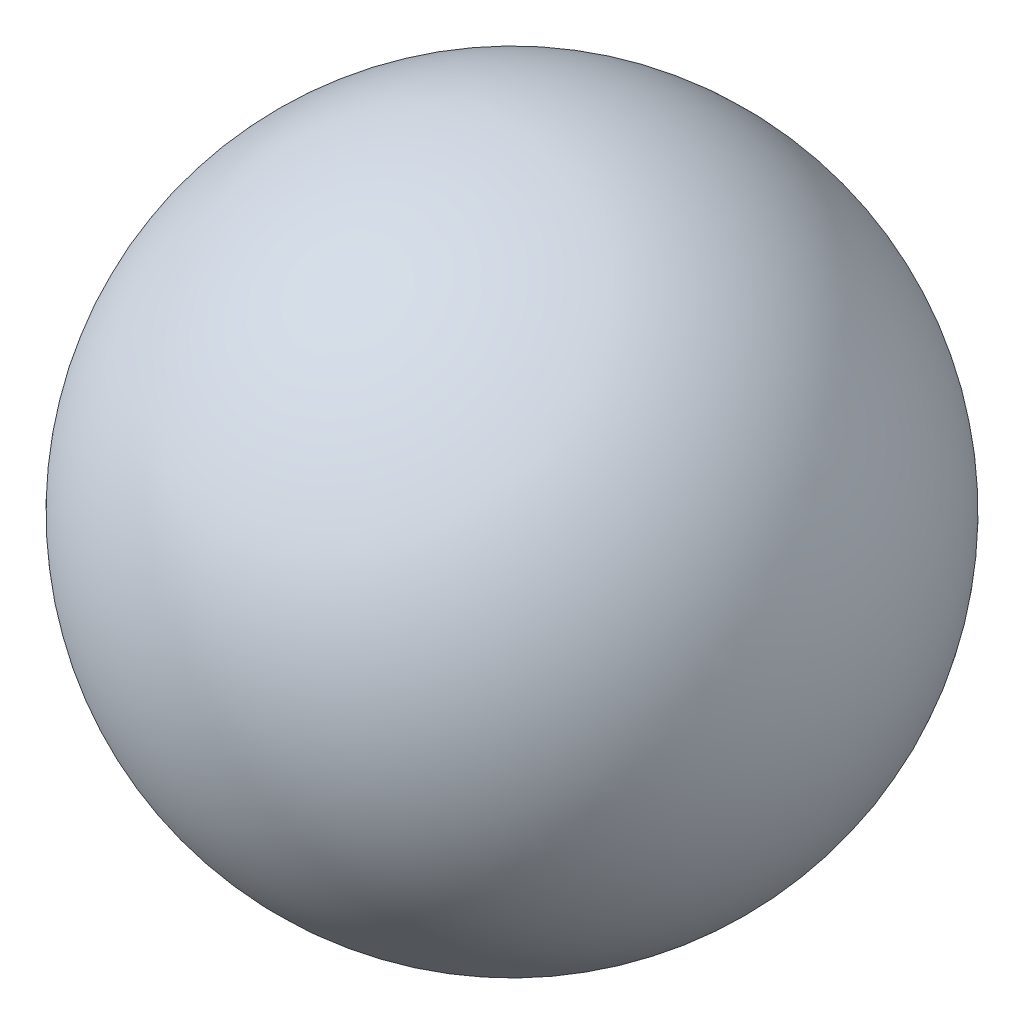
ISO-10303-21;
HEADER;
FILE_DESCRIPTION(('STEP AP214'),'2;1');
FILE_NAME('part.step','',(''),(''),'','','');
FILE_SCHEMA(('AUTOMOTIVE_DESIGN { 1 0 10303 214 1 1 1 1 }'));
ENDSEC;
DATA;
#1=APPLICATION_CONTEXT('core data for automotive mechanical design processes');
#2=APPLICATION_PROTOCOL_DEFINITION('international standard','automotive_design',2000,#1);
#3=PRODUCT_CONTEXT('',#1,'mechanical');
#4=PRODUCT('Part','Part','',(#3));
#5=PRODUCT_RELATED_PRODUCT_CATEGORY('part','',(#4));
#6=PRODUCT_DEFINITION_FORMATION('','',#4);
#7=PRODUCT_DEFINITION_CONTEXT('part definition',#1,'design');
#8=PRODUCT_DEFINITION('design','',#6,#7);
#9=PRODUCT_DEFINITION_SHAPE('','',#8);
#10=(LENGTH_UNIT() NAMED_UNIT(*) SI_UNIT(.MILLI.,.METRE.));
#11=(NAMED_UNIT(*) PLANE_ANGLE_UNIT() SI_UNIT($,.RADIAN.));
#12=(NAMED_UNIT(*) SI_UNIT($,.STERADIAN.) SOLID_ANGLE_UNIT());
#13=UNCERTAINTY_MEASURE_WITH_UNIT(LENGTH_MEASURE(1.E-05),#10,'distance_accuracy_value','');
#14=(GEOMETRIC_REPRESENTATION_CONTEXT(3) GLOBAL_UNCERTAINTY_ASSIGNED_CONTEXT((#13)) GLOBAL_UNIT_ASSIGNED_CONTEXT((#10,
#11,#12)) REPRESENTATION_CONTEXT('',''));
#15=CARTESIAN_POINT('',(0.,0.,0.));
#16=DIRECTION('',(0.,0.,1.));
#17=DIRECTION('',(1.,0.,0.));
#18=AXIS2_PLACEMENT_3D('',#15,#16,#17);
#19=CARTESIAN_POINT('',(64.16,51.118928564109,-46.9132799051348));
#20=DIRECTION('',(0.,0.736764460517836,-0.676149487700658));
#21=DIRECTION('',(0.173648177666933,0.66587725768284,0.725571352861821));
#22=AXIS2_PLACEMENT_3D('',#19,#20,#21);
#23=SPHERICAL_SURFACE('',#22,7.15);
#24=CARTESIAN_POINT('',(64.16,56.3867944568115,-51.7477487421945));
#25=VERTEX_POINT('',#24);
#26=VERTEX_LOOP('',#25);
#27=FACE_BOUND('',#26,.T.);
#28=CARTESIAN_POINT('',(64.16,45.8510626714065,-42.0788110680751));
#29=VERTEX_POINT('',#28);
#30=VERTEX_LOOP('',#29);
#31=FACE_BOUND('',#30,.T.);
#32=ADVANCED_FACE('F16',(#27,#31),#23,.T.);
#33=CLOSED_SHELL('',(#32));
#34=MANIFOLD_SOLID_BREP('B1',#33);
#35=ADVANCED_BREP_SHAPE_REPRESENTATION('',(#18,#34),#14);
#36=SHAPE_DEFINITION_REPRESENTATION(#9,#35);
ENDSEC;
END-ISO-10303-21;
